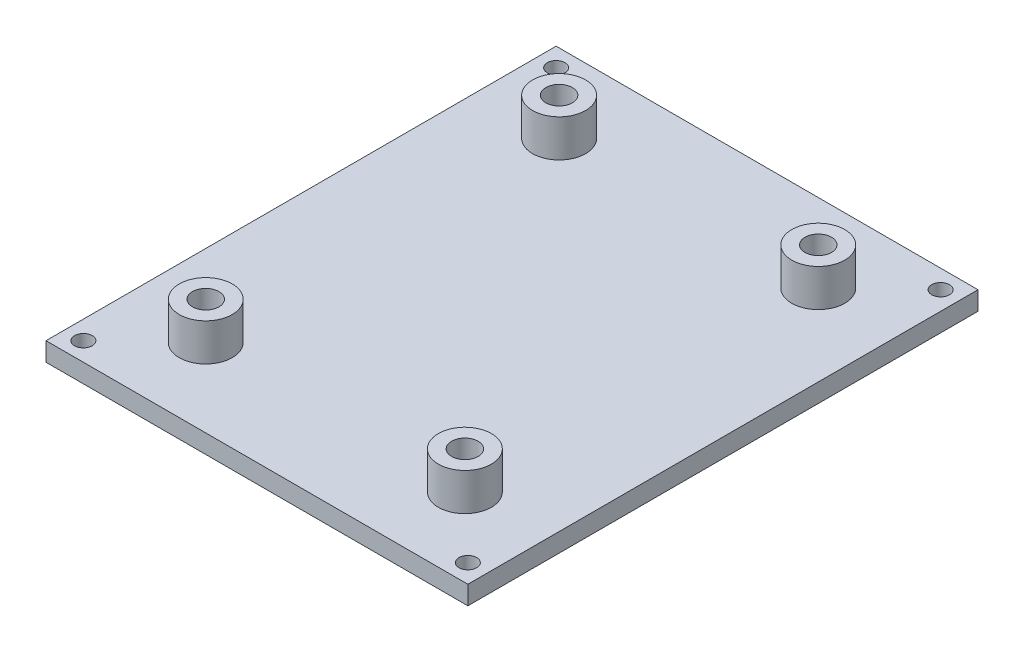
ISO-10303-21;
HEADER;
FILE_DESCRIPTION(('STEP AP214'),'2;1');
FILE_NAME('part.step','',(''),(''),'','','');
FILE_SCHEMA(('AUTOMOTIVE_DESIGN { 1 0 10303 214 1 1 1 1 }'));
ENDSEC;
DATA;
#1=APPLICATION_CONTEXT('core data for automotive mechanical design processes');
#2=APPLICATION_PROTOCOL_DEFINITION('international standard','automotive_design',2000,#1);
#3=PRODUCT_CONTEXT('',#1,'mechanical');
#4=PRODUCT('Part','Part','',(#3));
#5=PRODUCT_RELATED_PRODUCT_CATEGORY('part','',(#4));
#6=PRODUCT_DEFINITION_FORMATION('','',#4);
#7=PRODUCT_DEFINITION_CONTEXT('part definition',#1,'design');
#8=PRODUCT_DEFINITION('design','',#6,#7);
#9=PRODUCT_DEFINITION_SHAPE('','',#8);
#10=(LENGTH_UNIT() NAMED_UNIT(*) SI_UNIT(.MILLI.,.METRE.));
#11=(NAMED_UNIT(*) PLANE_ANGLE_UNIT() SI_UNIT($,.RADIAN.));
#12=(NAMED_UNIT(*) SI_UNIT($,.STERADIAN.) SOLID_ANGLE_UNIT());
#13=UNCERTAINTY_MEASURE_WITH_UNIT(LENGTH_MEASURE(1.E-05),#10,'distance_accuracy_value','');
#14=(GEOMETRIC_REPRESENTATION_CONTEXT(3) GLOBAL_UNCERTAINTY_ASSIGNED_CONTEXT((#13)) GLOBAL_UNIT_ASSIGNED_CONTEXT((#10,
#11,#12)) REPRESENTATION_CONTEXT('',''));
#15=CARTESIAN_POINT('',(0.,0.,0.));
#16=DIRECTION('',(0.,0.,1.));
#17=DIRECTION('',(1.,0.,0.));
#18=AXIS2_PLACEMENT_3D('',#15,#16,#17);
#19=CARTESIAN_POINT('',(-35.814,1.5875,-43.307));
#20=DIRECTION('',(1.,0.,0.));
#21=DIRECTION('',(0.,0.,-1.));
#22=AXIS2_PLACEMENT_3D('',#19,#20,#21);
#23=PLANE('',#22);
#24=DIRECTION('',(0.,0.,1.));
#25=VECTOR('',#24,1.);
#26=CARTESIAN_POINT('',(-35.814,-1.5875,-43.307));
#27=LINE('',#26,#25);
#28=CARTESIAN_POINT('',(-35.814,-1.5875,-43.307));
#29=VERTEX_POINT('',#28);
#30=CARTESIAN_POINT('',(-35.814,-1.5875,43.307));
#31=VERTEX_POINT('',#30);
#32=EDGE_CURVE('E102',#29,#31,#27,.T.);
#33=ORIENTED_EDGE('',*,*,#32,.T.);
#34=DIRECTION('',(0.,-1.,0.));
#35=VECTOR('',#34,1.);
#36=CARTESIAN_POINT('',(-35.814,1.5875,43.307));
#37=LINE('',#36,#35);
#38=CARTESIAN_POINT('',(-35.814,1.5875,43.307));
#39=VERTEX_POINT('',#38);
#40=EDGE_CURVE('E93',#39,#31,#37,.T.);
#41=ORIENTED_EDGE('',*,*,#40,.F.);
#42=DIRECTION('',(0.,0.,1.));
#43=VECTOR('',#42,1.);
#44=CARTESIAN_POINT('',(-35.814,1.5875,-43.307));
#45=LINE('',#44,#43);
#46=CARTESIAN_POINT('',(-35.814,1.5875,-43.307));
#47=VERTEX_POINT('',#46);
#48=EDGE_CURVE('E87',#47,#39,#45,.T.);
#49=ORIENTED_EDGE('',*,*,#48,.F.);
#50=DIRECTION('',(0.,-1.,0.));
#51=VECTOR('',#50,1.);
#52=CARTESIAN_POINT('',(-35.814,1.5875,-43.307));
#53=LINE('',#52,#51);
#54=EDGE_CURVE('E98',#47,#29,#53,.T.);
#55=ORIENTED_EDGE('',*,*,#54,.T.);
#56=EDGE_LOOP('',(#33,#41,#49,#55));
#57=FACE_BOUND('',#56,.T.);
#58=ADVANCED_FACE('F35',(#57),#23,.F.);
#59=CARTESIAN_POINT('',(-35.814,1.5875,43.307));
#60=DIRECTION('',(0.,0.,-1.));
#61=DIRECTION('',(-1.,0.,0.));
#62=AXIS2_PLACEMENT_3D('',#59,#60,#61);
#63=PLANE('',#62);
#64=DIRECTION('',(1.,0.,0.));
#65=VECTOR('',#64,1.);
#66=CARTESIAN_POINT('',(-35.814,-1.5875,43.307));
#67=LINE('',#66,#65);
#68=CARTESIAN_POINT('',(35.814,-1.5875,43.307));
#69=VERTEX_POINT('',#68);
#70=EDGE_CURVE('E92',#31,#69,#67,.T.);
#71=ORIENTED_EDGE('',*,*,#70,.T.);
#72=DIRECTION('',(0.,-1.,0.));
#73=VECTOR('',#72,1.);
#74=CARTESIAN_POINT('',(35.814,1.5875,43.307));
#75=LINE('',#74,#73);
#76=CARTESIAN_POINT('',(35.814,1.5875,43.307));
#77=VERTEX_POINT('',#76);
#78=EDGE_CURVE('E90',#77,#69,#75,.T.);
#79=ORIENTED_EDGE('',*,*,#78,.F.);
#80=DIRECTION('',(1.,0.,0.));
#81=VECTOR('',#80,1.);
#82=CARTESIAN_POINT('',(-35.814,1.5875,43.307));
#83=LINE('',#82,#81);
#84=EDGE_CURVE('E82',#39,#77,#83,.T.);
#85=ORIENTED_EDGE('',*,*,#84,.F.);
#86=ORIENTED_EDGE('',*,*,#40,.T.);
#87=EDGE_LOOP('',(#71,#79,#85,#86));
#88=FACE_BOUND('',#87,.T.);
#89=ADVANCED_FACE('F91',(#88),#63,.F.);
#90=CARTESIAN_POINT('',(35.814,1.5875,-43.307));
#91=DIRECTION('',(-1.,0.,0.));
#92=DIRECTION('',(0.,0.,1.));
#93=AXIS2_PLACEMENT_3D('',#90,#91,#92);
#94=PLANE('',#93);
#95=DIRECTION('',(0.,0.,-1.));
#96=VECTOR('',#95,1.);
#97=CARTESIAN_POINT('',(35.814,-1.5875,-43.307));
#98=LINE('',#97,#96);
#99=CARTESIAN_POINT('',(35.814,-1.5875,-43.307));
#100=VERTEX_POINT('',#99);
#101=EDGE_CURVE('E68',#69,#100,#98,.T.);
#102=ORIENTED_EDGE('',*,*,#101,.T.);
#103=DIRECTION('',(0.,-1.,0.));
#104=VECTOR('',#103,1.);
#105=CARTESIAN_POINT('',(35.814,1.5875,-43.307));
#106=LINE('',#105,#104);
#107=CARTESIAN_POINT('',(35.814,1.5875,-43.307));
#108=VERTEX_POINT('',#107);
#109=EDGE_CURVE('E94',#108,#100,#106,.T.);
#110=ORIENTED_EDGE('',*,*,#109,.F.);
#111=DIRECTION('',(0.,0.,-1.));
#112=VECTOR('',#111,1.);
#113=CARTESIAN_POINT('',(35.814,1.5875,-43.307));
#114=LINE('',#113,#112);
#115=EDGE_CURVE('E85',#77,#108,#114,.T.);
#116=ORIENTED_EDGE('',*,*,#115,.F.);
#117=ORIENTED_EDGE('',*,*,#78,.T.);
#118=EDGE_LOOP('',(#102,#110,#116,#117));
#119=FACE_BOUND('',#118,.T.);
#120=ADVANCED_FACE('F96',(#119),#94,.F.);
#121=CARTESIAN_POINT('',(-35.814,1.5875,-43.307));
#122=DIRECTION('',(0.,0.,1.));
#123=DIRECTION('',(1.,0.,0.));
#124=AXIS2_PLACEMENT_3D('',#121,#122,#123);
#125=PLANE('',#124);
#126=DIRECTION('',(-1.,0.,0.));
#127=VECTOR('',#126,1.);
#128=CARTESIAN_POINT('',(-35.814,-1.5875,-43.307));
#129=LINE('',#128,#127);
#130=EDGE_CURVE('E74',#100,#29,#129,.T.);
#131=ORIENTED_EDGE('',*,*,#130,.T.);
#132=ORIENTED_EDGE('',*,*,#54,.F.);
#133=DIRECTION('',(-1.,0.,0.));
#134=VECTOR('',#133,1.);
#135=CARTESIAN_POINT('',(-35.814,1.5875,-43.307));
#136=LINE('',#135,#134);
#137=EDGE_CURVE('E51',#108,#47,#136,.T.);
#138=ORIENTED_EDGE('',*,*,#137,.F.);
#139=ORIENTED_EDGE('',*,*,#109,.T.);
#140=EDGE_LOOP('',(#131,#132,#138,#139));
#141=FACE_BOUND('',#140,.T.);
#142=ADVANCED_FACE('F195',(#141),#125,.F.);
#143=CARTESIAN_POINT('',(0.,1.5875,0.));
#144=DIRECTION('',(0.,1.,0.));
#145=DIRECTION('',(0.,0.,1.));
#146=AXIS2_PLACEMENT_3D('',#143,#144,#145);
#147=PLANE('',#146);
#148=CARTESIAN_POINT('',(-22.,1.5875,30.));
#149=DIRECTION('',(0.,1.,0.));
#150=DIRECTION('',(0.,0.,1.));
#151=AXIS2_PLACEMENT_3D('',#148,#149,#150);
#152=CIRCLE('',#151,4.500000017);
#153=CARTESIAN_POINT('',(-22.,1.5875,34.500000017));
#154=VERTEX_POINT('',#153);
#155=EDGE_CURVE('E142',#154,#154,#152,.T.);
#156=ORIENTED_EDGE('',*,*,#155,.F.);
#157=EDGE_LOOP('',(#156));
#158=FACE_BOUND('',#157,.T.);
#159=CARTESIAN_POINT('',(22.,1.5875,30.));
#160=DIRECTION('',(0.,1.,0.));
#161=DIRECTION('',(0.,0.,1.));
#162=AXIS2_PLACEMENT_3D('',#159,#160,#161);
#163=CIRCLE('',#162,4.500000017);
#164=CARTESIAN_POINT('',(22.,1.5875,34.500000017));
#165=VERTEX_POINT('',#164);
#166=EDGE_CURVE('E133',#165,#165,#163,.T.);
#167=ORIENTED_EDGE('',*,*,#166,.F.);
#168=EDGE_LOOP('',(#167));
#169=FACE_BOUND('',#168,.T.);
#170=CARTESIAN_POINT('',(22.,1.5875,-30.));
#171=DIRECTION('',(0.,1.,0.));
#172=DIRECTION('',(0.,0.,1.));
#173=AXIS2_PLACEMENT_3D('',#170,#171,#172);
#174=CIRCLE('',#173,4.500000017);
#175=CARTESIAN_POINT('',(22.,1.5875,-25.499999983));
#176=VERTEX_POINT('',#175);
#177=EDGE_CURVE('E136',#176,#176,#174,.T.);
#178=ORIENTED_EDGE('',*,*,#177,.F.);
#179=EDGE_LOOP('',(#178));
#180=FACE_BOUND('',#179,.T.);
#181=CARTESIAN_POINT('',(-22.,1.5875,-30.));
#182=DIRECTION('',(0.,1.,0.));
#183=DIRECTION('',(0.,0.,1.));
#184=AXIS2_PLACEMENT_3D('',#181,#182,#183);
#185=CIRCLE('',#184,4.500000017);
#186=CARTESIAN_POINT('',(-22.,1.5875,-25.499999983));
#187=VERTEX_POINT('',#186);
#188=EDGE_CURVE('E151',#187,#187,#185,.T.);
#189=ORIENTED_EDGE('',*,*,#188,.F.);
#190=EDGE_LOOP('',(#189));
#191=FACE_BOUND('',#190,.T.);
#192=CARTESIAN_POINT('',(32.639,1.5875,40.132));
#193=DIRECTION('',(0.,1.,0.));
#194=DIRECTION('',(0.,0.,-1.));
#195=AXIS2_PLACEMENT_3D('',#192,#193,#194);
#196=CIRCLE('',#195,1.5);
#197=CARTESIAN_POINT('',(32.639,1.5875,38.632));
#198=VERTEX_POINT('',#197);
#199=EDGE_CURVE('E160',#198,#198,#196,.T.);
#200=ORIENTED_EDGE('',*,*,#199,.F.);
#201=EDGE_LOOP('',(#200));
#202=FACE_BOUND('',#201,.T.);
#203=CARTESIAN_POINT('',(32.639,1.5875,-40.132));
#204=DIRECTION('',(0.,-1.,0.));
#205=DIRECTION('',(0.,0.,1.));
#206=AXIS2_PLACEMENT_3D('',#203,#204,#205);
#207=CIRCLE('',#206,1.5);
#208=CARTESIAN_POINT('',(32.639,1.5875,-38.632));
#209=VERTEX_POINT('',#208);
#210=EDGE_CURVE('E169',#209,#209,#207,.T.);
#211=ORIENTED_EDGE('',*,*,#210,.T.);
#212=EDGE_LOOP('',(#211));
#213=FACE_BOUND('',#212,.T.);
#214=CARTESIAN_POINT('',(-32.639,1.5875,40.132));
#215=DIRECTION('',(0.,-1.,0.));
#216=DIRECTION('',(0.,0.,-1.));
#217=AXIS2_PLACEMENT_3D('',#214,#215,#216);
#218=CIRCLE('',#217,1.5);
#219=CARTESIAN_POINT('',(-32.639,1.5875,38.632));
#220=VERTEX_POINT('',#219);
#221=EDGE_CURVE('E175',#220,#220,#218,.T.);
#222=ORIENTED_EDGE('',*,*,#221,.T.);
#223=EDGE_LOOP('',(#222));
#224=FACE_BOUND('',#223,.T.);
#225=CARTESIAN_POINT('',(-32.639,1.5875,-40.132));
#226=DIRECTION('',(0.,1.,0.));
#227=DIRECTION('',(0.,0.,1.));
#228=AXIS2_PLACEMENT_3D('',#225,#226,#227);
#229=CIRCLE('',#228,1.5);
#230=CARTESIAN_POINT('',(-32.639,1.5875,-38.632));
#231=VERTEX_POINT('',#230);
#232=EDGE_CURVE('E178',#231,#231,#229,.T.);
#233=ORIENTED_EDGE('',*,*,#232,.F.);
#234=EDGE_LOOP('',(#233));
#235=FACE_BOUND('',#234,.T.);
#236=ORIENTED_EDGE('',*,*,#48,.T.);
#237=ORIENTED_EDGE('',*,*,#84,.T.);
#238=ORIENTED_EDGE('',*,*,#115,.T.);
#239=ORIENTED_EDGE('',*,*,#137,.T.);
#240=EDGE_LOOP('',(#236,#237,#238,#239));
#241=FACE_BOUND('',#240,.T.);
#242=ADVANCED_FACE('F83',(#158,#169,#180,#191,#202,#213,#224,#235,#241),#147,.T.);
#243=CARTESIAN_POINT('',(0.,-1.5875,0.));
#244=DIRECTION('',(0.,1.,0.));
#245=DIRECTION('',(0.,0.,1.));
#246=AXIS2_PLACEMENT_3D('',#243,#244,#245);
#247=PLANE('',#246);
#248=CARTESIAN_POINT('',(32.639,-1.5875,40.132));
#249=DIRECTION('',(0.,1.,0.));
#250=DIRECTION('',(0.,0.,1.));
#251=AXIS2_PLACEMENT_3D('',#248,#249,#250);
#252=CIRCLE('',#251,1.5);
#253=CARTESIAN_POINT('',(32.639,-1.5875,41.632));
#254=VERTEX_POINT('',#253);
#255=EDGE_CURVE('E165',#254,#254,#252,.F.);
#256=ORIENTED_EDGE('',*,*,#255,.F.);
#257=EDGE_LOOP('',(#256));
#258=FACE_BOUND('',#257,.T.);
#259=CARTESIAN_POINT('',(32.639,-1.5875,-40.132));
#260=DIRECTION('',(0.,1.,0.));
#261=DIRECTION('',(0.,0.,1.));
#262=AXIS2_PLACEMENT_3D('',#259,#260,#261);
#263=CIRCLE('',#262,1.5);
#264=CARTESIAN_POINT('',(32.639,-1.5875,-38.632));
#265=VERTEX_POINT('',#264);
#266=EDGE_CURVE('E168',#265,#265,#263,.T.);
#267=ORIENTED_EDGE('',*,*,#266,.T.);
#268=EDGE_LOOP('',(#267));
#269=FACE_BOUND('',#268,.T.);
#270=CARTESIAN_POINT('',(-32.639,-1.5875,40.132));
#271=DIRECTION('',(0.,1.,0.));
#272=DIRECTION('',(0.,0.,1.));
#273=AXIS2_PLACEMENT_3D('',#270,#271,#272);
#274=CIRCLE('',#273,1.5);
#275=CARTESIAN_POINT('',(-32.639,-1.5875,41.632));
#276=VERTEX_POINT('',#275);
#277=EDGE_CURVE('E172',#276,#276,#274,.T.);
#278=ORIENTED_EDGE('',*,*,#277,.T.);
#279=EDGE_LOOP('',(#278));
#280=FACE_BOUND('',#279,.T.);
#281=CARTESIAN_POINT('',(-32.639,-1.5875,-40.132));
#282=DIRECTION('',(0.,1.,0.));
#283=DIRECTION('',(0.,0.,1.));
#284=AXIS2_PLACEMENT_3D('',#281,#282,#283);
#285=CIRCLE('',#284,1.5);
#286=CARTESIAN_POINT('',(-32.639,-1.5875,-38.632));
#287=VERTEX_POINT('',#286);
#288=EDGE_CURVE('E105',#287,#287,#285,.F.);
#289=ORIENTED_EDGE('',*,*,#288,.F.);
#290=EDGE_LOOP('',(#289));
#291=FACE_BOUND('',#290,.T.);
#292=ORIENTED_EDGE('',*,*,#32,.F.);
#293=ORIENTED_EDGE('',*,*,#130,.F.);
#294=ORIENTED_EDGE('',*,*,#101,.F.);
#295=ORIENTED_EDGE('',*,*,#70,.F.);
#296=EDGE_LOOP('',(#292,#293,#294,#295));
#297=FACE_BOUND('',#296,.T.);
#298=ADVANCED_FACE('F188',(#258,#269,#280,#291,#297),#247,.F.);
#299=CARTESIAN_POINT('',(-32.639,-1.5885,-40.132));
#300=DIRECTION('',(0.,1.,0.));
#301=DIRECTION('',(0.,0.,1.));
#302=AXIS2_PLACEMENT_3D('',#299,#300,#301);
#303=CYLINDRICAL_SURFACE('',#302,1.5);
#304=ORIENTED_EDGE('',*,*,#232,.T.);
#305=EDGE_LOOP('',(#304));
#306=FACE_BOUND('',#305,.T.);
#307=ORIENTED_EDGE('',*,*,#288,.T.);
#308=EDGE_LOOP('',(#307));
#309=FACE_BOUND('',#308,.T.);
#310=ADVANCED_FACE('F186',(#306,#309),#303,.F.);
#311=CARTESIAN_POINT('',(-32.639,-1.5885,40.132));
#312=DIRECTION('',(0.,1.,0.));
#313=DIRECTION('',(0.,0.,1.));
#314=AXIS2_PLACEMENT_3D('',#311,#312,#313);
#315=CYLINDRICAL_SURFACE('',#314,1.5);
#316=ORIENTED_EDGE('',*,*,#221,.F.);
#317=EDGE_LOOP('',(#316));
#318=FACE_BOUND('',#317,.T.);
#319=ORIENTED_EDGE('',*,*,#277,.F.);
#320=EDGE_LOOP('',(#319));
#321=FACE_BOUND('',#320,.T.);
#322=ADVANCED_FACE('F229',(#318,#321),#315,.F.);
#323=CARTESIAN_POINT('',(32.639,-1.5885,-40.132));
#324=DIRECTION('',(0.,1.,0.));
#325=DIRECTION('',(0.,0.,1.));
#326=AXIS2_PLACEMENT_3D('',#323,#324,#325);
#327=CYLINDRICAL_SURFACE('',#326,1.5);
#328=ORIENTED_EDGE('',*,*,#210,.F.);
#329=EDGE_LOOP('',(#328));
#330=FACE_BOUND('',#329,.T.);
#331=ORIENTED_EDGE('',*,*,#266,.F.);
#332=EDGE_LOOP('',(#331));
#333=FACE_BOUND('',#332,.T.);
#334=ADVANCED_FACE('F245',(#330,#333),#327,.F.);
#335=CARTESIAN_POINT('',(32.639,-1.5885,40.132));
#336=DIRECTION('',(0.,1.,0.));
#337=DIRECTION('',(0.,0.,1.));
#338=AXIS2_PLACEMENT_3D('',#335,#336,#337);
#339=CYLINDRICAL_SURFACE('',#338,1.5);
#340=ORIENTED_EDGE('',*,*,#199,.T.);
#341=EDGE_LOOP('',(#340));
#342=FACE_BOUND('',#341,.T.);
#343=ORIENTED_EDGE('',*,*,#255,.T.);
#344=EDGE_LOOP('',(#343));
#345=FACE_BOUND('',#344,.T.);
#346=ADVANCED_FACE('F255',(#342,#345),#339,.F.);
#347=CARTESIAN_POINT('',(-22.,7.9375,-30.));
#348=DIRECTION('',(0.,-1.,0.));
#349=DIRECTION('',(0.,0.,-1.));
#350=AXIS2_PLACEMENT_3D('',#347,#348,#349);
#351=CYLINDRICAL_SURFACE('',#350,4.500000017);
#352=CARTESIAN_POINT('',(-22.,7.9375,-30.));
#353=DIRECTION('',(0.,1.,0.));
#354=DIRECTION('',(0.,0.,1.));
#355=AXIS2_PLACEMENT_3D('',#352,#353,#354);
#356=CIRCLE('',#355,4.500000017);
#357=CARTESIAN_POINT('',(-22.,7.9375,-25.499999983));
#358=VERTEX_POINT('',#357);
#359=EDGE_CURVE('E154',#358,#358,#356,.T.);
#360=ORIENTED_EDGE('',*,*,#359,.F.);
#361=EDGE_LOOP('',(#360));
#362=FACE_BOUND('',#361,.T.);
#363=ORIENTED_EDGE('',*,*,#188,.T.);
#364=EDGE_LOOP('',(#363));
#365=FACE_BOUND('',#364,.T.);
#366=ADVANCED_FACE('F265',(#362,#365),#351,.T.);
#367=CARTESIAN_POINT('',(-22.,7.9375,-30.));
#368=DIRECTION('',(0.,-1.,0.));
#369=DIRECTION('',(0.,0.,-1.));
#370=AXIS2_PLACEMENT_3D('',#367,#368,#369);
#371=CYLINDRICAL_SURFACE('',#370,2.2499955);
#372=CARTESIAN_POINT('',(-22.,2.137499916,-30.));
#373=DIRECTION('',(0.,1.,0.));
#374=DIRECTION('',(0.,0.,1.));
#375=AXIS2_PLACEMENT_3D('',#372,#373,#374);
#376=CIRCLE('',#375,2.2499955);
#377=CARTESIAN_POINT('',(-22.,2.137499916,-27.7500045));
#378=VERTEX_POINT('',#377);
#379=EDGE_CURVE('E112',#378,#378,#376,.T.);
#380=ORIENTED_EDGE('',*,*,#379,.F.);
#381=EDGE_LOOP('',(#380));
#382=FACE_BOUND('',#381,.T.);
#383=CARTESIAN_POINT('',(-22.,7.9375,-30.));
#384=DIRECTION('',(0.,1.,0.));
#385=DIRECTION('',(0.,0.,1.));
#386=AXIS2_PLACEMENT_3D('',#383,#384,#385);
#387=CIRCLE('',#386,2.2499955);
#388=CARTESIAN_POINT('',(-22.,7.9375,-27.7500045));
#389=VERTEX_POINT('',#388);
#390=EDGE_CURVE('E157',#389,#389,#387,.T.);
#391=ORIENTED_EDGE('',*,*,#390,.T.);
#392=EDGE_LOOP('',(#391));
#393=FACE_BOUND('',#392,.T.);
#394=ADVANCED_FACE('F280',(#382,#393),#371,.F.);
#395=CARTESIAN_POINT('',(0.,7.9375,0.));
#396=DIRECTION('',(0.,1.,0.));
#397=DIRECTION('',(0.,0.,1.));
#398=AXIS2_PLACEMENT_3D('',#395,#396,#397);
#399=PLANE('',#398);
#400=ORIENTED_EDGE('',*,*,#359,.T.);
#401=EDGE_LOOP('',(#400));
#402=FACE_BOUND('',#401,.T.);
#403=ORIENTED_EDGE('',*,*,#390,.F.);
#404=EDGE_LOOP('',(#403));
#405=FACE_BOUND('',#404,.T.);
#406=ADVANCED_FACE('F288',(#402,#405),#399,.T.);
#407=CARTESIAN_POINT('',(22.,7.9375,-30.));
#408=DIRECTION('',(0.,-1.,0.));
#409=DIRECTION('',(0.,0.,-1.));
#410=AXIS2_PLACEMENT_3D('',#407,#408,#409);
#411=CYLINDRICAL_SURFACE('',#410,2.2499955);
#412=CARTESIAN_POINT('',(22.,2.137499916,-30.));
#413=DIRECTION('',(0.,1.,0.));
#414=DIRECTION('',(0.,0.,1.));
#415=AXIS2_PLACEMENT_3D('',#412,#413,#414);
#416=CIRCLE('',#415,2.2499955);
#417=CARTESIAN_POINT('',(22.,2.137499916,-27.7500045));
#418=VERTEX_POINT('',#417);
#419=EDGE_CURVE('E115',#418,#418,#416,.T.);
#420=ORIENTED_EDGE('',*,*,#419,.F.);
#421=EDGE_LOOP('',(#420));
#422=FACE_BOUND('',#421,.T.);
#423=CARTESIAN_POINT('',(22.,7.9375,-30.));
#424=DIRECTION('',(0.,1.,0.));
#425=DIRECTION('',(0.,0.,1.));
#426=AXIS2_PLACEMENT_3D('',#423,#424,#425);
#427=CIRCLE('',#426,2.2499955);
#428=CARTESIAN_POINT('',(22.,7.9375,-27.7500045));
#429=VERTEX_POINT('',#428);
#430=EDGE_CURVE('E145',#429,#429,#427,.T.);
#431=ORIENTED_EDGE('',*,*,#430,.T.);
#432=EDGE_LOOP('',(#431));
#433=FACE_BOUND('',#432,.T.);
#434=ADVANCED_FACE('F293',(#422,#433),#411,.F.);
#435=CARTESIAN_POINT('',(22.,7.9375,-30.));
#436=DIRECTION('',(0.,-1.,0.));
#437=DIRECTION('',(0.,0.,-1.));
#438=AXIS2_PLACEMENT_3D('',#435,#436,#437);
#439=CYLINDRICAL_SURFACE('',#438,4.500000017);
#440=CARTESIAN_POINT('',(22.,7.9375,-30.));
#441=DIRECTION('',(0.,1.,0.));
#442=DIRECTION('',(0.,0.,1.));
#443=AXIS2_PLACEMENT_3D('',#440,#441,#442);
#444=CIRCLE('',#443,4.500000017);
#445=CARTESIAN_POINT('',(22.,7.9375,-25.499999983));
#446=VERTEX_POINT('',#445);
#447=EDGE_CURVE('E148',#446,#446,#444,.T.);
#448=ORIENTED_EDGE('',*,*,#447,.F.);
#449=EDGE_LOOP('',(#448));
#450=FACE_BOUND('',#449,.T.);
#451=ORIENTED_EDGE('',*,*,#177,.T.);
#452=EDGE_LOOP('',(#451));
#453=FACE_BOUND('',#452,.T.);
#454=ADVANCED_FACE('F302',(#450,#453),#439,.T.);
#455=CARTESIAN_POINT('',(0.,7.9375,0.));
#456=DIRECTION('',(0.,1.,0.));
#457=DIRECTION('',(0.,0.,1.));
#458=AXIS2_PLACEMENT_3D('',#455,#456,#457);
#459=PLANE('',#458);
#460=ORIENTED_EDGE('',*,*,#430,.F.);
#461=EDGE_LOOP('',(#460));
#462=FACE_BOUND('',#461,.T.);
#463=ORIENTED_EDGE('',*,*,#447,.T.);
#464=EDGE_LOOP('',(#463));
#465=FACE_BOUND('',#464,.T.);
#466=ADVANCED_FACE('F126',(#462,#465),#459,.T.);
#467=CARTESIAN_POINT('',(22.,7.9375,30.));
#468=DIRECTION('',(0.,-1.,0.));
#469=DIRECTION('',(0.,0.,-1.));
#470=AXIS2_PLACEMENT_3D('',#467,#468,#469);
#471=CYLINDRICAL_SURFACE('',#470,2.2499955);
#472=CARTESIAN_POINT('',(22.,2.137499916,30.));
#473=DIRECTION('',(0.,1.,0.));
#474=DIRECTION('',(0.,0.,1.));
#475=AXIS2_PLACEMENT_3D('',#472,#473,#474);
#476=CIRCLE('',#475,2.2499955);
#477=CARTESIAN_POINT('',(22.,2.137499916,32.2499955));
#478=VERTEX_POINT('',#477);
#479=EDGE_CURVE('E43',#478,#478,#476,.T.);
#480=ORIENTED_EDGE('',*,*,#479,.F.);
#481=EDGE_LOOP('',(#480));
#482=FACE_BOUND('',#481,.T.);
#483=CARTESIAN_POINT('',(22.,7.9375,30.));
#484=DIRECTION('',(0.,1.,0.));
#485=DIRECTION('',(0.,0.,1.));
#486=AXIS2_PLACEMENT_3D('',#483,#484,#485);
#487=CIRCLE('',#486,2.2499955);
#488=CARTESIAN_POINT('',(22.,7.9375,32.2499955));
#489=VERTEX_POINT('',#488);
#490=EDGE_CURVE('E130',#489,#489,#487,.T.);
#491=ORIENTED_EDGE('',*,*,#490,.T.);
#492=EDGE_LOOP('',(#491));
#493=FACE_BOUND('',#492,.T.);
#494=ADVANCED_FACE('F122',(#482,#493),#471,.F.);
#495=CARTESIAN_POINT('',(22.,7.9375,30.));
#496=DIRECTION('',(0.,-1.,0.));
#497=DIRECTION('',(0.,0.,-1.));
#498=AXIS2_PLACEMENT_3D('',#495,#496,#497);
#499=CYLINDRICAL_SURFACE('',#498,4.500000017);
#500=CARTESIAN_POINT('',(22.,7.9375,30.));
#501=DIRECTION('',(0.,1.,0.));
#502=DIRECTION('',(0.,0.,1.));
#503=AXIS2_PLACEMENT_3D('',#500,#501,#502);
#504=CIRCLE('',#503,4.500000017);
#505=CARTESIAN_POINT('',(22.,7.9375,34.500000017));
#506=VERTEX_POINT('',#505);
#507=EDGE_CURVE('E132',#506,#506,#504,.T.);
#508=ORIENTED_EDGE('',*,*,#507,.F.);
#509=EDGE_LOOP('',(#508));
#510=FACE_BOUND('',#509,.T.);
#511=ORIENTED_EDGE('',*,*,#166,.T.);
#512=EDGE_LOOP('',(#511));
#513=FACE_BOUND('',#512,.T.);
#514=ADVANCED_FACE('F125',(#510,#513),#499,.T.);
#515=CARTESIAN_POINT('',(0.,7.9375,0.));
#516=DIRECTION('',(0.,1.,0.));
#517=DIRECTION('',(0.,0.,1.));
#518=AXIS2_PLACEMENT_3D('',#515,#516,#517);
#519=PLANE('',#518);
#520=ORIENTED_EDGE('',*,*,#490,.F.);
#521=EDGE_LOOP('',(#520));
#522=FACE_BOUND('',#521,.T.);
#523=ORIENTED_EDGE('',*,*,#507,.T.);
#524=EDGE_LOOP('',(#523));
#525=FACE_BOUND('',#524,.T.);
#526=ADVANCED_FACE('F327',(#522,#525),#519,.T.);
#527=CARTESIAN_POINT('',(-22.,7.9375,30.));
#528=DIRECTION('',(0.,-1.,0.));
#529=DIRECTION('',(0.,0.,-1.));
#530=AXIS2_PLACEMENT_3D('',#527,#528,#529);
#531=CYLINDRICAL_SURFACE('',#530,4.500000017);
#532=CARTESIAN_POINT('',(-22.,7.9375,30.));
#533=DIRECTION('',(0.,1.,0.));
#534=DIRECTION('',(0.,0.,1.));
#535=AXIS2_PLACEMENT_3D('',#532,#533,#534);
#536=CIRCLE('',#535,4.500000017);
#537=CARTESIAN_POINT('',(-22.,7.9375,34.500000017));
#538=VERTEX_POINT('',#537);
#539=EDGE_CURVE('E440',#538,#538,#536,.T.);
#540=ORIENTED_EDGE('',*,*,#539,.F.);
#541=EDGE_LOOP('',(#540));
#542=FACE_BOUND('',#541,.T.);
#543=ORIENTED_EDGE('',*,*,#155,.T.);
#544=EDGE_LOOP('',(#543));
#545=FACE_BOUND('',#544,.T.);
#546=ADVANCED_FACE('F338',(#542,#545),#531,.T.);
#547=CARTESIAN_POINT('',(-22.,7.9375,30.));
#548=DIRECTION('',(0.,-1.,0.));
#549=DIRECTION('',(0.,0.,-1.));
#550=AXIS2_PLACEMENT_3D('',#547,#548,#549);
#551=CYLINDRICAL_SURFACE('',#550,2.2499955);
#552=CARTESIAN_POINT('',(-22.,2.137499916,30.));
#553=DIRECTION('',(0.,1.,0.));
#554=DIRECTION('',(0.,0.,1.));
#555=AXIS2_PLACEMENT_3D('',#552,#553,#554);
#556=CIRCLE('',#555,2.2499955);
#557=CARTESIAN_POINT('',(-22.,2.137499916,32.2499955));
#558=VERTEX_POINT('',#557);
#559=EDGE_CURVE('E11',#558,#558,#556,.T.);
#560=ORIENTED_EDGE('',*,*,#559,.F.);
#561=EDGE_LOOP('',(#560));
#562=FACE_BOUND('',#561,.T.);
#563=CARTESIAN_POINT('',(-22.,7.9375,30.));
#564=DIRECTION('',(0.,1.,0.));
#565=DIRECTION('',(0.,0.,1.));
#566=AXIS2_PLACEMENT_3D('',#563,#564,#565);
#567=CIRCLE('',#566,2.2499955);
#568=CARTESIAN_POINT('',(-22.,7.9375,32.2499955));
#569=VERTEX_POINT('',#568);
#570=EDGE_CURVE('E139',#569,#569,#567,.T.);
#571=ORIENTED_EDGE('',*,*,#570,.T.);
#572=EDGE_LOOP('',(#571));
#573=FACE_BOUND('',#572,.T.);
#574=ADVANCED_FACE('F347',(#562,#573),#551,.F.);
#575=CARTESIAN_POINT('',(0.,7.9375,0.));
#576=DIRECTION('',(0.,1.,0.));
#577=DIRECTION('',(0.,0.,1.));
#578=AXIS2_PLACEMENT_3D('',#575,#576,#577);
#579=PLANE('',#578);
#580=ORIENTED_EDGE('',*,*,#539,.T.);
#581=EDGE_LOOP('',(#580));
#582=FACE_BOUND('',#581,.T.);
#583=ORIENTED_EDGE('',*,*,#570,.F.);
#584=EDGE_LOOP('',(#583));
#585=FACE_BOUND('',#584,.T.);
#586=ADVANCED_FACE('F355',(#582,#585),#579,.T.);
#587=CARTESIAN_POINT('',(0.,2.137499916,0.));
#588=DIRECTION('',(0.,1.,0.));
#589=DIRECTION('',(0.,0.,1.));
#590=AXIS2_PLACEMENT_3D('',#587,#588,#589);
#591=PLANE('',#590);
#592=ORIENTED_EDGE('',*,*,#379,.T.);
#593=EDGE_LOOP('',(#592));
#594=FACE_BOUND('',#593,.T.);
#595=ADVANCED_FACE('F360',(#594),#591,.T.);
#596=CARTESIAN_POINT('',(0.,2.137499916,0.));
#597=DIRECTION('',(0.,1.,0.));
#598=DIRECTION('',(0.,0.,1.));
#599=AXIS2_PLACEMENT_3D('',#596,#597,#598);
#600=PLANE('',#599);
#601=ORIENTED_EDGE('',*,*,#419,.T.);
#602=EDGE_LOOP('',(#601));
#603=FACE_BOUND('',#602,.T.);
#604=ADVANCED_FACE('F398',(#603),#600,.T.);
#605=CARTESIAN_POINT('',(0.,2.137499916,0.));
#606=DIRECTION('',(0.,1.,0.));
#607=DIRECTION('',(0.,0.,1.));
#608=AXIS2_PLACEMENT_3D('',#605,#606,#607);
#609=PLANE('',#608);
#610=ORIENTED_EDGE('',*,*,#479,.T.);
#611=EDGE_LOOP('',(#610));
#612=FACE_BOUND('',#611,.T.);
#613=ADVANCED_FACE('F120',(#612),#609,.T.);
#614=CARTESIAN_POINT('',(0.,2.137499916,0.));
#615=DIRECTION('',(0.,1.,0.));
#616=DIRECTION('',(0.,0.,1.));
#617=AXIS2_PLACEMENT_3D('',#614,#615,#616);
#618=PLANE('',#617);
#619=ORIENTED_EDGE('',*,*,#559,.T.);
#620=EDGE_LOOP('',(#619));
#621=FACE_BOUND('',#620,.T.);
#622=ADVANCED_FACE('F419',(#621),#618,.T.);
#623=CLOSED_SHELL('',(#58,#89,#120,#142,#242,#298,#310,#322,#334,#346,#366,#394,#406,#434,#454,
#466,#494,#514,#526,#546,#574,#586,#595,#604,#613,#622));
#624=MANIFOLD_SOLID_BREP('B2',#623);
#625=ADVANCED_BREP_SHAPE_REPRESENTATION('',(#18,#624),#14);
#626=SHAPE_DEFINITION_REPRESENTATION(#9,#625);
ENDSEC;
END-ISO-10303-21;
